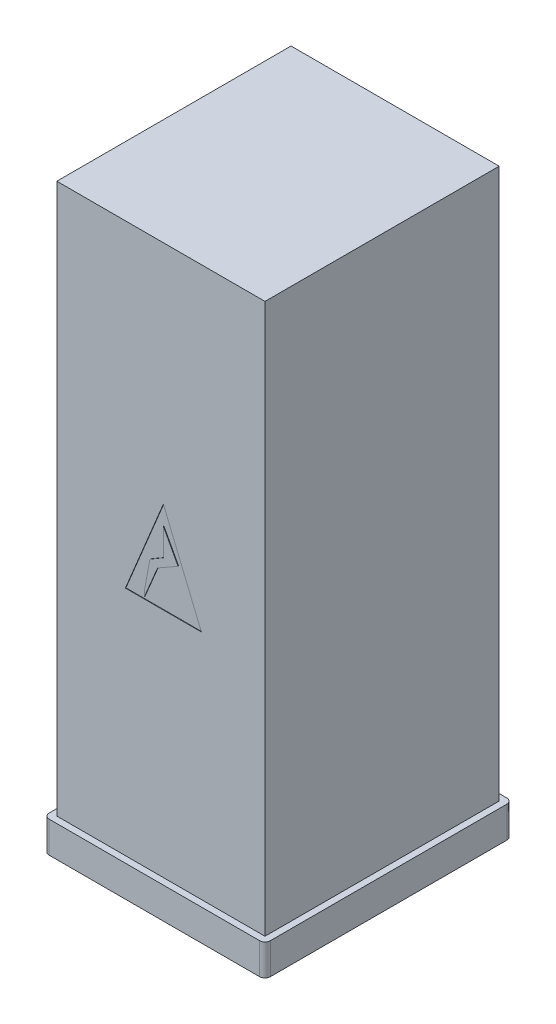
ISO-10303-21;
HEADER;
FILE_DESCRIPTION(('STEP AP214'),'2;1');
FILE_NAME('part.step','',(''),(''),'','','');
FILE_SCHEMA(('AUTOMOTIVE_DESIGN { 1 0 10303 214 1 1 1 1 }'));
ENDSEC;
DATA;
#1=APPLICATION_CONTEXT('core data for automotive mechanical design processes');
#2=APPLICATION_PROTOCOL_DEFINITION('international standard','automotive_design',2000,#1);
#3=PRODUCT_CONTEXT('',#1,'mechanical');
#4=PRODUCT('Part','Part','',(#3));
#5=PRODUCT_RELATED_PRODUCT_CATEGORY('part','',(#4));
#6=PRODUCT_DEFINITION_FORMATION('','',#4);
#7=PRODUCT_DEFINITION_CONTEXT('part definition',#1,'design');
#8=PRODUCT_DEFINITION('design','',#6,#7);
#9=PRODUCT_DEFINITION_SHAPE('','',#8);
#10=(LENGTH_UNIT() NAMED_UNIT(*) SI_UNIT(.MILLI.,.METRE.));
#11=(NAMED_UNIT(*) PLANE_ANGLE_UNIT() SI_UNIT($,.RADIAN.));
#12=(NAMED_UNIT(*) SI_UNIT($,.STERADIAN.) SOLID_ANGLE_UNIT());
#13=UNCERTAINTY_MEASURE_WITH_UNIT(LENGTH_MEASURE(1.E-05),#10,'distance_accuracy_value','');
#14=(GEOMETRIC_REPRESENTATION_CONTEXT(3) GLOBAL_UNCERTAINTY_ASSIGNED_CONTEXT((#13)) GLOBAL_UNIT_ASSIGNED_CONTEXT((#10,
#11,#12)) REPRESENTATION_CONTEXT('',''));
#15=CARTESIAN_POINT('',(0.,0.,0.));
#16=DIRECTION('',(0.,0.,1.));
#17=DIRECTION('',(1.,0.,0.));
#18=AXIS2_PLACEMENT_3D('',#15,#16,#17);
#19=CARTESIAN_POINT('',(-400.,2113.,450.));
#20=DIRECTION('',(0.,0.,-1.));
#21=DIRECTION('',(-1.,0.,0.));
#22=AXIS2_PLACEMENT_3D('',#19,#20,#21);
#23=PLANE('',#22);
#24=DIRECTION('',(1.,0.,0.));
#25=VECTOR('',#24,1.);
#26=CARTESIAN_POINT('',(-136.509991438893,890.520139483411,450.));
#27=LINE('',#26,#25);
#28=CARTESIAN_POINT('',(-136.509991438893,890.520139483411,450.));
#29=VERTEX_POINT('',#28);
#30=CARTESIAN_POINT('',(155.469712472072,890.520139483411,450.));
#31=VERTEX_POINT('',#30);
#32=EDGE_CURVE('E307',#29,#31,#27,.T.);
#33=ORIENTED_EDGE('',*,*,#32,.F.);
#34=DIRECTION('',(-0.382498039412264,-0.923956302995858,0.));
#35=VECTOR('',#34,1.);
#36=CARTESIAN_POINT('',(9.47986051658978,1243.17095070055,450.));
#37=LINE('',#36,#35);
#38=CARTESIAN_POINT('',(9.47986051658978,1243.17095070055,450.));
#39=VERTEX_POINT('',#38);
#40=EDGE_CURVE('E52',#39,#29,#37,.T.);
#41=ORIENTED_EDGE('',*,*,#40,.F.);
#42=DIRECTION('',(-0.382498039412264,0.923956302995858,0.));
#43=VECTOR('',#42,1.);
#44=CARTESIAN_POINT('',(155.469712472072,890.520139483411,450.));
#45=LINE('',#44,#43);
#46=EDGE_CURVE('E299',#31,#39,#45,.T.);
#47=ORIENTED_EDGE('',*,*,#46,.F.);
#48=EDGE_LOOP('',(#33,#41,#47));
#49=FACE_BOUND('',#48,.T.);
#50=DIRECTION('',(1.,0.,0.));
#51=VECTOR('',#50,1.);
#52=CARTESIAN_POINT('',(-400.,0.,450.));
#53=LINE('',#52,#51);
#54=CARTESIAN_POINT('',(-400.,0.,450.));
#55=VERTEX_POINT('',#54);
#56=CARTESIAN_POINT('',(400.,0.,450.));
#57=VERTEX_POINT('',#56);
#58=EDGE_CURVE('E350',#55,#57,#53,.T.);
#59=ORIENTED_EDGE('',*,*,#58,.T.);
#60=DIRECTION('',(0.,-1.,0.));
#61=VECTOR('',#60,1.);
#62=CARTESIAN_POINT('',(400.,2113.,450.));
#63=LINE('',#62,#61);
#64=CARTESIAN_POINT('',(400.,2113.,450.));
#65=VERTEX_POINT('',#64);
#66=EDGE_CURVE('E356',#65,#57,#63,.T.);
#67=ORIENTED_EDGE('',*,*,#66,.F.);
#68=DIRECTION('',(1.,0.,0.));
#69=VECTOR('',#68,1.);
#70=CARTESIAN_POINT('',(-400.,2113.,450.));
#71=LINE('',#70,#69);
#72=CARTESIAN_POINT('',(-400.,2113.,450.));
#73=VERTEX_POINT('',#72);
#74=EDGE_CURVE('E354',#73,#65,#71,.T.);
#75=ORIENTED_EDGE('',*,*,#74,.F.);
#76=DIRECTION('',(0.,-1.,0.));
#77=VECTOR('',#76,1.);
#78=CARTESIAN_POINT('',(-400.,2113.,450.));
#79=LINE('',#78,#77);
#80=EDGE_CURVE('E369',#73,#55,#79,.T.);
#81=ORIENTED_EDGE('',*,*,#80,.T.);
#82=EDGE_LOOP('',(#59,#67,#75,#81));
#83=FACE_BOUND('',#82,.T.);
#84=ADVANCED_FACE('F36',(#49,#83),#23,.F.);
#85=CARTESIAN_POINT('',(400.,2113.,-450.));
#86=DIRECTION('',(-1.,0.,0.));
#87=DIRECTION('',(0.,0.,1.));
#88=AXIS2_PLACEMENT_3D('',#85,#86,#87);
#89=PLANE('',#88);
#90=DIRECTION('',(0.,0.,-1.));
#91=VECTOR('',#90,1.);
#92=CARTESIAN_POINT('',(400.,0.,-450.));
#93=LINE('',#92,#91);
#94=CARTESIAN_POINT('',(400.,0.,-450.));
#95=VERTEX_POINT('',#94);
#96=EDGE_CURVE('E332',#57,#95,#93,.T.);
#97=ORIENTED_EDGE('',*,*,#96,.T.);
#98=DIRECTION('',(0.,-1.,0.));
#99=VECTOR('',#98,1.);
#100=CARTESIAN_POINT('',(400.,2113.,-450.));
#101=LINE('',#100,#99);
#102=CARTESIAN_POINT('',(400.,2113.,-450.));
#103=VERTEX_POINT('',#102);
#104=EDGE_CURVE('E11',#103,#95,#101,.T.);
#105=ORIENTED_EDGE('',*,*,#104,.F.);
#106=DIRECTION('',(0.,0.,-1.));
#107=VECTOR('',#106,1.);
#108=CARTESIAN_POINT('',(400.,2113.,-450.));
#109=LINE('',#108,#107);
#110=EDGE_CURVE('E346',#65,#103,#109,.T.);
#111=ORIENTED_EDGE('',*,*,#110,.F.);
#112=ORIENTED_EDGE('',*,*,#66,.T.);
#113=EDGE_LOOP('',(#97,#105,#111,#112));
#114=FACE_BOUND('',#113,.T.);
#115=ADVANCED_FACE('F38',(#114),#89,.F.);
#116=CARTESIAN_POINT('',(-400.,2113.,-450.));
#117=DIRECTION('',(0.,0.,1.));
#118=DIRECTION('',(1.,0.,0.));
#119=AXIS2_PLACEMENT_3D('',#116,#117,#118);
#120=PLANE('',#119);
#121=DIRECTION('',(-1.,0.,0.));
#122=VECTOR('',#121,1.);
#123=CARTESIAN_POINT('',(-400.,0.,-450.));
#124=LINE('',#123,#122);
#125=CARTESIAN_POINT('',(-400.,0.,-450.));
#126=VERTEX_POINT('',#125);
#127=EDGE_CURVE('E359',#95,#126,#124,.T.);
#128=ORIENTED_EDGE('',*,*,#127,.T.);
#129=DIRECTION('',(0.,-1.,0.));
#130=VECTOR('',#129,1.);
#131=CARTESIAN_POINT('',(-400.,2113.,-450.));
#132=LINE('',#131,#130);
#133=CARTESIAN_POINT('',(-400.,2113.,-450.));
#134=VERTEX_POINT('',#133);
#135=EDGE_CURVE('E45',#134,#126,#132,.T.);
#136=ORIENTED_EDGE('',*,*,#135,.F.);
#137=DIRECTION('',(-1.,0.,0.));
#138=VECTOR('',#137,1.);
#139=CARTESIAN_POINT('',(-400.,2113.,-450.));
#140=LINE('',#139,#138);
#141=EDGE_CURVE('E349',#103,#134,#140,.T.);
#142=ORIENTED_EDGE('',*,*,#141,.F.);
#143=ORIENTED_EDGE('',*,*,#104,.T.);
#144=EDGE_LOOP('',(#128,#136,#142,#143));
#145=FACE_BOUND('',#144,.T.);
#146=ADVANCED_FACE('F378',(#145),#120,.F.);
#147=CARTESIAN_POINT('',(-400.,2113.,-450.));
#148=DIRECTION('',(1.,0.,0.));
#149=DIRECTION('',(0.,0.,-1.));
#150=AXIS2_PLACEMENT_3D('',#147,#148,#149);
#151=PLANE('',#150);
#152=DIRECTION('',(0.,0.,1.));
#153=VECTOR('',#152,1.);
#154=CARTESIAN_POINT('',(-400.,0.,-450.));
#155=LINE('',#154,#153);
#156=EDGE_CURVE('E362',#126,#55,#155,.T.);
#157=ORIENTED_EDGE('',*,*,#156,.T.);
#158=ORIENTED_EDGE('',*,*,#80,.F.);
#159=DIRECTION('',(0.,0.,1.));
#160=VECTOR('',#159,1.);
#161=CARTESIAN_POINT('',(-400.,2113.,-450.));
#162=LINE('',#161,#160);
#163=EDGE_CURVE('E352',#134,#73,#162,.T.);
#164=ORIENTED_EDGE('',*,*,#163,.F.);
#165=ORIENTED_EDGE('',*,*,#135,.T.);
#166=EDGE_LOOP('',(#157,#158,#164,#165));
#167=FACE_BOUND('',#166,.T.);
#168=ADVANCED_FACE('F375',(#167),#151,.F.);
#169=CARTESIAN_POINT('',(0.,2113.,0.));
#170=DIRECTION('',(0.,1.,0.));
#171=DIRECTION('',(0.,0.,1.));
#172=AXIS2_PLACEMENT_3D('',#169,#170,#171);
#173=PLANE('',#172);
#174=ORIENTED_EDGE('',*,*,#110,.T.);
#175=ORIENTED_EDGE('',*,*,#141,.T.);
#176=ORIENTED_EDGE('',*,*,#163,.T.);
#177=ORIENTED_EDGE('',*,*,#74,.T.);
#178=EDGE_LOOP('',(#174,#175,#176,#177));
#179=FACE_BOUND('',#178,.T.);
#180=ADVANCED_FACE('F388',(#179),#173,.T.);
#181=CARTESIAN_POINT('',(9.47986051658978,1243.17095070055,448.));
#182=DIRECTION('',(-0.923956302995858,0.382498039412264,0.));
#183=DIRECTION('',(-0.382498039412264,-0.923956302995858,0.));
#184=AXIS2_PLACEMENT_3D('',#181,#182,#183);
#185=PLANE('',#184);
#186=ORIENTED_EDGE('',*,*,#40,.T.);
#187=DIRECTION('',(0.,0.,1.));
#188=VECTOR('',#187,1.);
#189=CARTESIAN_POINT('',(-136.509991438893,890.520139483411,448.));
#190=LINE('',#189,#188);
#191=CARTESIAN_POINT('',(-136.509991438893,890.520139483411,448.));
#192=VERTEX_POINT('',#191);
#193=EDGE_CURVE('E305',#192,#29,#190,.T.);
#194=ORIENTED_EDGE('',*,*,#193,.F.);
#195=DIRECTION('',(-0.382498039412264,-0.923956302995858,0.));
#196=VECTOR('',#195,1.);
#197=CARTESIAN_POINT('',(9.47986051658978,1243.17095070055,448.));
#198=LINE('',#197,#196);
#199=CARTESIAN_POINT('',(9.47986051658978,1243.17095070055,448.));
#200=VERTEX_POINT('',#199);
#201=EDGE_CURVE('E295',#200,#192,#198,.T.);
#202=ORIENTED_EDGE('',*,*,#201,.F.);
#203=DIRECTION('',(0.,0.,1.));
#204=VECTOR('',#203,1.);
#205=CARTESIAN_POINT('',(9.47986051658978,1243.17095070055,448.));
#206=LINE('',#205,#204);
#207=EDGE_CURVE('E312',#200,#39,#206,.T.);
#208=ORIENTED_EDGE('',*,*,#207,.T.);
#209=EDGE_LOOP('',(#186,#194,#202,#208));
#210=FACE_BOUND('',#209,.T.);
#211=ADVANCED_FACE('F390',(#210),#185,.F.);
#212=CARTESIAN_POINT('',(155.469712472072,890.520139483411,448.));
#213=DIRECTION('',(0.923956302995858,0.382498039412264,0.));
#214=DIRECTION('',(-0.382498039412264,0.923956302995858,0.));
#215=AXIS2_PLACEMENT_3D('',#212,#213,#214);
#216=PLANE('',#215);
#217=ORIENTED_EDGE('',*,*,#46,.T.);
#218=ORIENTED_EDGE('',*,*,#207,.F.);
#219=DIRECTION('',(-0.382498039412264,0.923956302995858,0.));
#220=VECTOR('',#219,1.);
#221=CARTESIAN_POINT('',(155.469712472072,890.520139483411,448.));
#222=LINE('',#221,#220);
#223=CARTESIAN_POINT('',(155.469712472072,890.520139483411,448.));
#224=VERTEX_POINT('',#223);
#225=EDGE_CURVE('E302',#224,#200,#222,.T.);
#226=ORIENTED_EDGE('',*,*,#225,.F.);
#227=DIRECTION('',(0.,0.,1.));
#228=VECTOR('',#227,1.);
#229=CARTESIAN_POINT('',(155.469712472072,890.520139483411,448.));
#230=LINE('',#229,#228);
#231=EDGE_CURVE('E315',#224,#31,#230,.T.);
#232=ORIENTED_EDGE('',*,*,#231,.T.);
#233=EDGE_LOOP('',(#217,#218,#226,#232));
#234=FACE_BOUND('',#233,.T.);
#235=ADVANCED_FACE('F396',(#234),#216,.F.);
#236=CARTESIAN_POINT('',(-136.509991438893,890.520139483411,448.));
#237=DIRECTION('',(0.,-1.,0.));
#238=DIRECTION('',(0.,0.,-1.));
#239=AXIS2_PLACEMENT_3D('',#236,#237,#238);
#240=PLANE('',#239);
#241=ORIENTED_EDGE('',*,*,#32,.T.);
#242=ORIENTED_EDGE('',*,*,#231,.F.);
#243=DIRECTION('',(1.,0.,0.));
#244=VECTOR('',#243,1.);
#245=CARTESIAN_POINT('',(-136.509991438893,890.520139483411,448.));
#246=LINE('',#245,#244);
#247=EDGE_CURVE('E298',#192,#224,#246,.T.);
#248=ORIENTED_EDGE('',*,*,#247,.F.);
#249=ORIENTED_EDGE('',*,*,#193,.T.);
#250=EDGE_LOOP('',(#241,#242,#248,#249));
#251=FACE_BOUND('',#250,.T.);
#252=ADVANCED_FACE('F464',(#251),#240,.F.);
#253=CARTESIAN_POINT('',(0.,0.,448.));
#254=DIRECTION('',(0.,0.,1.));
#255=DIRECTION('',(1.,0.,0.));
#256=AXIS2_PLACEMENT_3D('',#253,#254,#255);
#257=PLANE('',#256);
#258=DIRECTION('',(-0.181458170868249,-0.983398663932969,0.));
#259=VECTOR('',#258,1.);
#260=CARTESIAN_POINT('',(-63.1768087324265,920.194596150194,448.));
#261=LINE('',#260,#259);
#262=CARTESIAN_POINT('',(-42.1695458219167,1034.04184910241,448.));
#263=VERTEX_POINT('',#262);
#264=CARTESIAN_POINT('',(-63.1768087324265,920.194596150194,448.));
#265=VERTEX_POINT('',#264);
#266=EDGE_CURVE('E264',#263,#265,#261,.T.);
#267=ORIENTED_EDGE('',*,*,#266,.F.);
#268=DIRECTION('',(-0.863784349846672,-0.503861684353913,0.));
#269=VECTOR('',#268,1.);
#270=CARTESIAN_POINT('',(-42.1695458219167,1034.04184910241,448.));
#271=LINE('',#270,#269);
#272=CARTESIAN_POINT('',(9.47986051658978,1064.16992085807,448.));
#273=VERTEX_POINT('',#272);
#274=EDGE_CURVE('E261',#273,#263,#271,.T.);
#275=ORIENTED_EDGE('',*,*,#274,.F.);
#276=DIRECTION('',(0.,-1.,0.));
#277=VECTOR('',#276,1.);
#278=CARTESIAN_POINT('',(9.47986051658978,1064.16992085807,448.));
#279=LINE('',#278,#277);
#280=CARTESIAN_POINT('',(9.47986051658978,1169.41196385255,448.));
#281=VERTEX_POINT('',#280);
#282=EDGE_CURVE('E258',#281,#273,#279,.T.);
#283=ORIENTED_EDGE('',*,*,#282,.F.);
#284=DIRECTION('',(-0.472916146029514,0.881107438865767,0.));
#285=VECTOR('',#284,1.);
#286=CARTESIAN_POINT('',(9.47986051658978,1169.41196385255,448.));
#287=LINE('',#286,#285);
#288=CARTESIAN_POINT('',(65.9663446589673,1064.16992085807,448.));
#289=VERTEX_POINT('',#288);
#290=EDGE_CURVE('E255',#289,#281,#287,.T.);
#291=ORIENTED_EDGE('',*,*,#290,.F.);
#292=DIRECTION('',(0.869719659928419,0.493546059789758,0.));
#293=VECTOR('',#292,1.);
#294=CARTESIAN_POINT('',(65.9663446589673,1064.16992085807,448.));
#295=LINE('',#294,#293);
#296=CARTESIAN_POINT('',(-12.5323017641928,1019.62373037163,448.));
#297=VERTEX_POINT('',#296);
#298=EDGE_CURVE('E252',#297,#289,#295,.T.);
#299=ORIENTED_EDGE('',*,*,#298,.F.);
#300=DIRECTION('',(0.386882203116871,0.922129145462519,0.));
#301=VECTOR('',#300,1.);
#302=CARTESIAN_POINT('',(-12.5323017641928,1019.62373037163,448.));
#303=LINE('',#302,#301);
#304=CARTESIAN_POINT('',(-63.1768087324265,898.91314829587,448.));
#305=VERTEX_POINT('',#304);
#306=EDGE_CURVE('E248',#305,#297,#303,.T.);
#307=ORIENTED_EDGE('',*,*,#306,.F.);
#308=DIRECTION('',(0.,-1.,0.));
#309=VECTOR('',#308,1.);
#310=CARTESIAN_POINT('',(-63.1768087324265,898.91314829587,448.));
#311=LINE('',#310,#309);
#312=EDGE_CURVE('E245',#265,#305,#311,.T.);
#313=ORIENTED_EDGE('',*,*,#312,.F.);
#314=EDGE_LOOP('',(#267,#275,#283,#291,#299,#307,#313));
#315=FACE_BOUND('',#314,.T.);
#316=ORIENTED_EDGE('',*,*,#201,.T.);
#317=ORIENTED_EDGE('',*,*,#247,.T.);
#318=ORIENTED_EDGE('',*,*,#225,.T.);
#319=EDGE_LOOP('',(#316,#317,#318));
#320=FACE_BOUND('',#319,.T.);
#321=ADVANCED_FACE('F431',(#315,#320),#257,.T.);
#322=CARTESIAN_POINT('',(-63.1768087324265,898.91314829587,448.));
#323=DIRECTION('',(-1.,0.,0.));
#324=DIRECTION('',(0.,0.,1.));
#325=AXIS2_PLACEMENT_3D('',#322,#323,#324);
#326=PLANE('',#325);
#327=DIRECTION('',(0.,-1.,0.));
#328=VECTOR('',#327,1.);
#329=CARTESIAN_POINT('',(-63.1768087324265,898.91314829587,450.));
#330=LINE('',#329,#328);
#331=CARTESIAN_POINT('',(-63.1768087324265,920.194596150194,450.));
#332=VERTEX_POINT('',#331);
#333=CARTESIAN_POINT('',(-63.1768087324264,898.91314829587,450.));
#334=VERTEX_POINT('',#333);
#335=EDGE_CURVE('E236',#332,#334,#330,.T.);
#336=ORIENTED_EDGE('',*,*,#335,.F.);
#337=DIRECTION('',(0.,0.,1.));
#338=VECTOR('',#337,1.);
#339=CARTESIAN_POINT('',(-63.1768087324265,920.194596150194,448.));
#340=LINE('',#339,#338);
#341=EDGE_CURVE('E282',#265,#332,#340,.T.);
#342=ORIENTED_EDGE('',*,*,#341,.F.);
#343=ORIENTED_EDGE('',*,*,#312,.T.);
#344=DIRECTION('',(0.,0.,1.));
#345=VECTOR('',#344,1.);
#346=CARTESIAN_POINT('',(-63.1768087324265,898.91314829587,448.));
#347=LINE('',#346,#345);
#348=EDGE_CURVE('E266',#305,#334,#347,.T.);
#349=ORIENTED_EDGE('',*,*,#348,.T.);
#350=EDGE_LOOP('',(#336,#342,#343,#349));
#351=FACE_BOUND('',#350,.T.);
#352=ADVANCED_FACE('F424',(#351),#326,.T.);
#353=CARTESIAN_POINT('',(-63.1768087324265,920.194596150194,448.));
#354=DIRECTION('',(-0.983398663932969,0.181458170868249,0.));
#355=DIRECTION('',(-0.181458170868249,-0.983398663932969,0.));
#356=AXIS2_PLACEMENT_3D('',#353,#354,#355);
#357=PLANE('',#356);
#358=DIRECTION('',(-0.181458170868249,-0.983398663932969,0.));
#359=VECTOR('',#358,1.);
#360=CARTESIAN_POINT('',(-63.1768087324265,920.194596150194,450.));
#361=LINE('',#360,#359);
#362=CARTESIAN_POINT('',(-42.1695458219167,1034.04184910241,450.));
#363=VERTEX_POINT('',#362);
#364=EDGE_CURVE('E249',#363,#332,#361,.T.);
#365=ORIENTED_EDGE('',*,*,#364,.F.);
#366=DIRECTION('',(0.,0.,1.));
#367=VECTOR('',#366,1.);
#368=CARTESIAN_POINT('',(-42.1695458219167,1034.04184910241,448.));
#369=LINE('',#368,#367);
#370=EDGE_CURVE('E284',#263,#363,#369,.T.);
#371=ORIENTED_EDGE('',*,*,#370,.F.);
#372=ORIENTED_EDGE('',*,*,#266,.T.);
#373=ORIENTED_EDGE('',*,*,#341,.T.);
#374=EDGE_LOOP('',(#365,#371,#372,#373));
#375=FACE_BOUND('',#374,.T.);
#376=ADVANCED_FACE('F444',(#375),#357,.T.);
#377=CARTESIAN_POINT('',(-42.1695458219167,1034.04184910241,448.));
#378=DIRECTION('',(-0.503861684353913,0.863784349846672,0.));
#379=DIRECTION('',(-0.863784349846672,-0.503861684353913,0.));
#380=AXIS2_PLACEMENT_3D('',#377,#378,#379);
#381=PLANE('',#380);
#382=DIRECTION('',(-0.863784349846672,-0.503861684353913,0.));
#383=VECTOR('',#382,1.);
#384=CARTESIAN_POINT('',(-42.1695458219167,1034.04184910241,450.));
#385=LINE('',#384,#383);
#386=CARTESIAN_POINT('',(9.47986051658978,1064.16992085807,450.));
#387=VERTEX_POINT('',#386);
#388=EDGE_CURVE('E277',#387,#363,#385,.T.);
#389=ORIENTED_EDGE('',*,*,#388,.F.);
#390=DIRECTION('',(0.,0.,1.));
#391=VECTOR('',#390,1.);
#392=CARTESIAN_POINT('',(9.47986051658978,1064.16992085807,448.));
#393=LINE('',#392,#391);
#394=EDGE_CURVE('E286',#273,#387,#393,.T.);
#395=ORIENTED_EDGE('',*,*,#394,.F.);
#396=ORIENTED_EDGE('',*,*,#274,.T.);
#397=ORIENTED_EDGE('',*,*,#370,.T.);
#398=EDGE_LOOP('',(#389,#395,#396,#397));
#399=FACE_BOUND('',#398,.T.);
#400=ADVANCED_FACE('F442',(#399),#381,.T.);
#401=CARTESIAN_POINT('',(9.47986051658978,1064.16992085807,448.));
#402=DIRECTION('',(-1.,0.,0.));
#403=DIRECTION('',(0.,0.,1.));
#404=AXIS2_PLACEMENT_3D('',#401,#402,#403);
#405=PLANE('',#404);
#406=DIRECTION('',(0.,-1.,0.));
#407=VECTOR('',#406,1.);
#408=CARTESIAN_POINT('',(9.47986051658978,1064.16992085807,450.));
#409=LINE('',#408,#407);
#410=CARTESIAN_POINT('',(9.47986051658978,1169.41196385255,450.));
#411=VERTEX_POINT('',#410);
#412=EDGE_CURVE('E274',#411,#387,#409,.T.);
#413=ORIENTED_EDGE('',*,*,#412,.F.);
#414=DIRECTION('',(0.,0.,1.));
#415=VECTOR('',#414,1.);
#416=CARTESIAN_POINT('',(9.47986051658978,1169.41196385255,448.));
#417=LINE('',#416,#415);
#418=EDGE_CURVE('E288',#281,#411,#417,.T.);
#419=ORIENTED_EDGE('',*,*,#418,.F.);
#420=ORIENTED_EDGE('',*,*,#282,.T.);
#421=ORIENTED_EDGE('',*,*,#394,.T.);
#422=EDGE_LOOP('',(#413,#419,#420,#421));
#423=FACE_BOUND('',#422,.T.);
#424=ADVANCED_FACE('F440',(#423),#405,.T.);
#425=CARTESIAN_POINT('',(9.47986051658978,1169.41196385255,448.));
#426=DIRECTION('',(0.881107438865767,0.472916146029514,0.));
#427=DIRECTION('',(-0.472916146029514,0.881107438865767,0.));
#428=AXIS2_PLACEMENT_3D('',#425,#426,#427);
#429=PLANE('',#428);
#430=DIRECTION('',(-0.472916146029514,0.881107438865767,0.));
#431=VECTOR('',#430,1.);
#432=CARTESIAN_POINT('',(9.47986051658978,1169.41196385255,450.));
#433=LINE('',#432,#431);
#434=CARTESIAN_POINT('',(65.9663446589673,1064.16992085807,450.));
#435=VERTEX_POINT('',#434);
#436=EDGE_CURVE('E271',#435,#411,#433,.T.);
#437=ORIENTED_EDGE('',*,*,#436,.F.);
#438=DIRECTION('',(0.,0.,1.));
#439=VECTOR('',#438,1.);
#440=CARTESIAN_POINT('',(65.9663446589673,1064.16992085807,448.));
#441=LINE('',#440,#439);
#442=EDGE_CURVE('E290',#289,#435,#441,.T.);
#443=ORIENTED_EDGE('',*,*,#442,.F.);
#444=ORIENTED_EDGE('',*,*,#290,.T.);
#445=ORIENTED_EDGE('',*,*,#418,.T.);
#446=EDGE_LOOP('',(#437,#443,#444,#445));
#447=FACE_BOUND('',#446,.T.);
#448=ADVANCED_FACE('F436',(#447),#429,.T.);
#449=CARTESIAN_POINT('',(65.9663446589673,1064.16992085807,448.));
#450=DIRECTION('',(0.493546059789758,-0.869719659928419,0.));
#451=DIRECTION('',(0.869719659928419,0.493546059789758,0.));
#452=AXIS2_PLACEMENT_3D('',#449,#450,#451);
#453=PLANE('',#452);
#454=DIRECTION('',(0.869719659928419,0.493546059789758,0.));
#455=VECTOR('',#454,1.);
#456=CARTESIAN_POINT('',(65.9663446589673,1064.16992085807,450.));
#457=LINE('',#456,#455);
#458=CARTESIAN_POINT('',(-12.532301764193,1019.62373037163,450.));
#459=VERTEX_POINT('',#458);
#460=EDGE_CURVE('E60',#459,#435,#457,.T.);
#461=ORIENTED_EDGE('',*,*,#460,.F.);
#462=DIRECTION('',(0.,0.,1.));
#463=VECTOR('',#462,1.);
#464=CARTESIAN_POINT('',(-12.5323017641928,1019.62373037163,448.));
#465=LINE('',#464,#463);
#466=EDGE_CURVE('E292',#297,#459,#465,.T.);
#467=ORIENTED_EDGE('',*,*,#466,.F.);
#468=ORIENTED_EDGE('',*,*,#298,.T.);
#469=ORIENTED_EDGE('',*,*,#442,.T.);
#470=EDGE_LOOP('',(#461,#467,#468,#469));
#471=FACE_BOUND('',#470,.T.);
#472=ADVANCED_FACE('F417',(#471),#453,.T.);
#473=CARTESIAN_POINT('',(-12.5323017641928,1019.62373037163,448.));
#474=DIRECTION('',(0.922129145462519,-0.386882203116871,0.));
#475=DIRECTION('',(0.386882203116871,0.92212914546252,0.));
#476=AXIS2_PLACEMENT_3D('',#473,#474,#475);
#477=PLANE('',#476);
#478=DIRECTION('',(0.386882203116871,0.922129145462519,0.));
#479=VECTOR('',#478,1.);
#480=CARTESIAN_POINT('',(-12.5323017641928,1019.62373037163,450.));
#481=LINE('',#480,#479);
#482=EDGE_CURVE('E239',#334,#459,#481,.T.);
#483=ORIENTED_EDGE('',*,*,#482,.F.);
#484=ORIENTED_EDGE('',*,*,#348,.F.);
#485=ORIENTED_EDGE('',*,*,#306,.T.);
#486=ORIENTED_EDGE('',*,*,#466,.T.);
#487=EDGE_LOOP('',(#483,#484,#485,#486));
#488=FACE_BOUND('',#487,.T.);
#489=ADVANCED_FACE('F409',(#488),#477,.T.);
#490=ORIENTED_EDGE('',*,*,#335,.T.);
#491=ORIENTED_EDGE('',*,*,#482,.T.);
#492=ORIENTED_EDGE('',*,*,#460,.T.);
#493=ORIENTED_EDGE('',*,*,#436,.T.);
#494=ORIENTED_EDGE('',*,*,#412,.T.);
#495=ORIENTED_EDGE('',*,*,#388,.T.);
#496=ORIENTED_EDGE('',*,*,#364,.T.);
#497=EDGE_LOOP('',(#490,#491,#492,#493,#494,#495,#496));
#498=FACE_BOUND('',#497,.T.);
#499=ADVANCED_FACE('F403',(#498),#23,.F.);
#500=CARTESIAN_POINT('',(404.356451520061,0.,454.356451520061));
#501=DIRECTION('',(0.,1.,0.));
#502=DIRECTION('',(0.,0.,1.));
#503=AXIS2_PLACEMENT_3D('',#500,#501,#502);
#504=PLANE('',#503);
#505=CARTESIAN_POINT('',(404.356451520061,0.,454.356451520061));
#506=DIRECTION('',(0.,-1.,0.));
#507=DIRECTION('',(0.,0.,1.));
#508=AXIS2_PLACEMENT_3D('',#505,#506,#507);
#509=CIRCLE('',#508,20.6435484799389);
#510=CARTESIAN_POINT('',(425.,0.,454.356451520061));
#511=VERTEX_POINT('',#510);
#512=CARTESIAN_POINT('',(404.356451520061,0.,475.));
#513=VERTEX_POINT('',#512);
#514=EDGE_CURVE('E235',#511,#513,#509,.T.);
#515=ORIENTED_EDGE('',*,*,#514,.F.);
#516=DIRECTION('',(0.,0.,1.));
#517=VECTOR('',#516,1.);
#518=CARTESIAN_POINT('',(425.,0.,454.356451520061));
#519=LINE('',#518,#517);
#520=CARTESIAN_POINT('',(425.,0.,-454.356451520061));
#521=VERTEX_POINT('',#520);
#522=EDGE_CURVE('E231',#521,#511,#519,.T.);
#523=ORIENTED_EDGE('',*,*,#522,.F.);
#524=CARTESIAN_POINT('',(404.356451520061,0.,-454.356451520061));
#525=DIRECTION('',(0.,-1.,0.));
#526=DIRECTION('',(0.,0.,-1.));
#527=AXIS2_PLACEMENT_3D('',#524,#525,#526);
#528=CIRCLE('',#527,20.6435484799389);
#529=CARTESIAN_POINT('',(404.356451520061,0.,-475.));
#530=VERTEX_POINT('',#529);
#531=EDGE_CURVE('E762',#530,#521,#528,.T.);
#532=ORIENTED_EDGE('',*,*,#531,.F.);
#533=DIRECTION('',(1.,0.,0.));
#534=VECTOR('',#533,1.);
#535=CARTESIAN_POINT('',(-404.356451520061,0.,-475.));
#536=LINE('',#535,#534);
#537=CARTESIAN_POINT('',(-404.356451520061,0.,-475.));
#538=VERTEX_POINT('',#537);
#539=EDGE_CURVE('E778',#538,#530,#536,.T.);
#540=ORIENTED_EDGE('',*,*,#539,.F.);
#541=CARTESIAN_POINT('',(-404.356451520061,0.,-454.356451520061));
#542=DIRECTION('',(0.,-1.,0.));
#543=DIRECTION('',(0.,0.,-1.));
#544=AXIS2_PLACEMENT_3D('',#541,#542,#543);
#545=CIRCLE('',#544,20.6435484799389);
#546=CARTESIAN_POINT('',(-425.,0.,-454.356451520061));
#547=VERTEX_POINT('',#546);
#548=EDGE_CURVE('E776',#547,#538,#545,.T.);
#549=ORIENTED_EDGE('',*,*,#548,.F.);
#550=DIRECTION('',(0.,0.,-1.));
#551=VECTOR('',#550,1.);
#552=CARTESIAN_POINT('',(-425.,0.,454.356451520061));
#553=LINE('',#552,#551);
#554=CARTESIAN_POINT('',(-425.,0.,454.356451520061));
#555=VERTEX_POINT('',#554);
#556=EDGE_CURVE('E774',#555,#547,#553,.T.);
#557=ORIENTED_EDGE('',*,*,#556,.F.);
#558=CARTESIAN_POINT('',(-404.356451520061,0.,454.356451520061));
#559=DIRECTION('',(0.,-1.,0.));
#560=DIRECTION('',(0.,0.,-1.));
#561=AXIS2_PLACEMENT_3D('',#558,#559,#560);
#562=CIRCLE('',#561,20.6435484799389);
#563=CARTESIAN_POINT('',(-404.356451520061,0.,475.));
#564=VERTEX_POINT('',#563);
#565=EDGE_CURVE('E768',#564,#555,#562,.T.);
#566=ORIENTED_EDGE('',*,*,#565,.F.);
#567=DIRECTION('',(-1.,0.,0.));
#568=VECTOR('',#567,1.);
#569=CARTESIAN_POINT('',(-404.356451520061,0.,475.));
#570=LINE('',#569,#568);
#571=EDGE_CURVE('E766',#513,#564,#570,.T.);
#572=ORIENTED_EDGE('',*,*,#571,.F.);
#573=EDGE_LOOP('',(#515,#523,#532,#540,#549,#557,#566,#572));
#574=FACE_BOUND('',#573,.T.);
#575=ORIENTED_EDGE('',*,*,#58,.F.);
#576=ORIENTED_EDGE('',*,*,#156,.F.);
#577=ORIENTED_EDGE('',*,*,#127,.F.);
#578=ORIENTED_EDGE('',*,*,#96,.F.);
#579=EDGE_LOOP('',(#575,#576,#577,#578));
#580=FACE_BOUND('',#579,.T.);
#581=ADVANCED_FACE('F381',(#574,#580),#504,.T.);
#582=CARTESIAN_POINT('',(404.356451520061,-120.,454.356451520061));
#583=DIRECTION('',(0.,1.,0.));
#584=DIRECTION('',(0.,0.,1.));
#585=AXIS2_PLACEMENT_3D('',#582,#583,#584);
#586=CYLINDRICAL_SURFACE('',#585,20.6435484799389);
#587=ORIENTED_EDGE('',*,*,#514,.T.);
#588=DIRECTION('',(0.,1.,0.));
#589=VECTOR('',#588,1.);
#590=CARTESIAN_POINT('',(404.356451520061,-120.,475.));
#591=LINE('',#590,#589);
#592=CARTESIAN_POINT('',(404.356451520061,-120.,475.));
#593=VERTEX_POINT('',#592);
#594=EDGE_CURVE('E215',#593,#513,#591,.T.);
#595=ORIENTED_EDGE('',*,*,#594,.F.);
#596=CARTESIAN_POINT('',(404.356451520061,-120.,454.356451520061));
#597=DIRECTION('',(0.,-1.,0.));
#598=DIRECTION('',(0.,0.,1.));
#599=AXIS2_PLACEMENT_3D('',#596,#597,#598);
#600=CIRCLE('',#599,20.6435484799389);
#601=CARTESIAN_POINT('',(425.,-120.,454.356451520061));
#602=VERTEX_POINT('',#601);
#603=EDGE_CURVE('E222',#602,#593,#600,.T.);
#604=ORIENTED_EDGE('',*,*,#603,.F.);
#605=DIRECTION('',(0.,1.,0.));
#606=VECTOR('',#605,1.);
#607=CARTESIAN_POINT('',(425.,-120.,454.356451520061));
#608=LINE('',#607,#606);
#609=EDGE_CURVE('E758',#602,#511,#608,.T.);
#610=ORIENTED_EDGE('',*,*,#609,.T.);
#611=EDGE_LOOP('',(#587,#595,#604,#610));
#612=FACE_BOUND('',#611,.T.);
#613=ADVANCED_FACE('F233',(#612),#586,.T.);
#614=CARTESIAN_POINT('',(-404.356451520061,-120.,475.));
#615=DIRECTION('',(0.,0.,-1.));
#616=DIRECTION('',(-1.,0.,0.));
#617=AXIS2_PLACEMENT_3D('',#614,#615,#616);
#618=PLANE('',#617);
#619=ORIENTED_EDGE('',*,*,#571,.T.);
#620=DIRECTION('',(0.,1.,0.));
#621=VECTOR('',#620,1.);
#622=CARTESIAN_POINT('',(-404.356451520061,-120.,475.));
#623=LINE('',#622,#621);
#624=CARTESIAN_POINT('',(-404.356451520061,-120.,475.));
#625=VERTEX_POINT('',#624);
#626=EDGE_CURVE('E218',#625,#564,#623,.T.);
#627=ORIENTED_EDGE('',*,*,#626,.F.);
#628=DIRECTION('',(-1.,0.,0.));
#629=VECTOR('',#628,1.);
#630=CARTESIAN_POINT('',(-404.356451520061,-120.,475.));
#631=LINE('',#630,#629);
#632=EDGE_CURVE('E211',#593,#625,#631,.T.);
#633=ORIENTED_EDGE('',*,*,#632,.F.);
#634=ORIENTED_EDGE('',*,*,#594,.T.);
#635=EDGE_LOOP('',(#619,#627,#633,#634));
#636=FACE_BOUND('',#635,.T.);
#637=ADVANCED_FACE('F213',(#636),#618,.F.);
#638=CARTESIAN_POINT('',(-404.356451520061,-120.,454.356451520061));
#639=DIRECTION('',(0.,1.,0.));
#640=DIRECTION('',(0.,0.,1.));
#641=AXIS2_PLACEMENT_3D('',#638,#639,#640);
#642=CYLINDRICAL_SURFACE('',#641,20.6435484799389);
#643=ORIENTED_EDGE('',*,*,#565,.T.);
#644=DIRECTION('',(0.,1.,0.));
#645=VECTOR('',#644,1.);
#646=CARTESIAN_POINT('',(-425.,-120.,454.356451520061));
#647=LINE('',#646,#645);
#648=CARTESIAN_POINT('',(-425.,-120.,454.356451520061));
#649=VERTEX_POINT('',#648);
#650=EDGE_CURVE('E241',#649,#555,#647,.T.);
#651=ORIENTED_EDGE('',*,*,#650,.F.);
#652=CARTESIAN_POINT('',(-404.356451520061,-120.,454.356451520061));
#653=DIRECTION('',(0.,-1.,0.));
#654=DIRECTION('',(0.,0.,-1.));
#655=AXIS2_PLACEMENT_3D('',#652,#653,#654);
#656=CIRCLE('',#655,20.6435484799389);
#657=EDGE_CURVE('E221',#625,#649,#656,.T.);
#658=ORIENTED_EDGE('',*,*,#657,.F.);
#659=ORIENTED_EDGE('',*,*,#626,.T.);
#660=EDGE_LOOP('',(#643,#651,#658,#659));
#661=FACE_BOUND('',#660,.T.);
#662=ADVANCED_FACE('F646',(#661),#642,.T.);
#663=CARTESIAN_POINT('',(-425.,-120.,454.356451520061));
#664=DIRECTION('',(1.,0.,0.));
#665=DIRECTION('',(0.,0.,-1.));
#666=AXIS2_PLACEMENT_3D('',#663,#664,#665);
#667=PLANE('',#666);
#668=ORIENTED_EDGE('',*,*,#556,.T.);
#669=DIRECTION('',(0.,1.,0.));
#670=VECTOR('',#669,1.);
#671=CARTESIAN_POINT('',(-425.,-120.,-454.356451520061));
#672=LINE('',#671,#670);
#673=CARTESIAN_POINT('',(-425.,-120.,-454.356451520061));
#674=VERTEX_POINT('',#673);
#675=EDGE_CURVE('E788',#674,#547,#672,.T.);
#676=ORIENTED_EDGE('',*,*,#675,.F.);
#677=DIRECTION('',(0.,0.,-1.));
#678=VECTOR('',#677,1.);
#679=CARTESIAN_POINT('',(-425.,-120.,454.356451520061));
#680=LINE('',#679,#678);
#681=EDGE_CURVE('E795',#649,#674,#680,.T.);
#682=ORIENTED_EDGE('',*,*,#681,.F.);
#683=ORIENTED_EDGE('',*,*,#650,.T.);
#684=EDGE_LOOP('',(#668,#676,#682,#683));
#685=FACE_BOUND('',#684,.T.);
#686=ADVANCED_FACE('F655',(#685),#667,.F.);
#687=CARTESIAN_POINT('',(-404.356451520061,-120.,-454.356451520061));
#688=DIRECTION('',(0.,1.,0.));
#689=DIRECTION('',(0.,0.,1.));
#690=AXIS2_PLACEMENT_3D('',#687,#688,#689);
#691=CYLINDRICAL_SURFACE('',#690,20.6435484799389);
#692=ORIENTED_EDGE('',*,*,#548,.T.);
#693=DIRECTION('',(0.,1.,0.));
#694=VECTOR('',#693,1.);
#695=CARTESIAN_POINT('',(-404.356451520061,-120.,-475.));
#696=LINE('',#695,#694);
#697=CARTESIAN_POINT('',(-404.356451520061,-120.,-475.));
#698=VERTEX_POINT('',#697);
#699=EDGE_CURVE('E785',#698,#538,#696,.T.);
#700=ORIENTED_EDGE('',*,*,#699,.F.);
#701=CARTESIAN_POINT('',(-404.356451520061,-120.,-454.356451520061));
#702=DIRECTION('',(0.,-1.,0.));
#703=DIRECTION('',(0.,0.,-1.));
#704=AXIS2_PLACEMENT_3D('',#701,#702,#703);
#705=CIRCLE('',#704,20.6435484799389);
#706=EDGE_CURVE('E805',#674,#698,#705,.T.);
#707=ORIENTED_EDGE('',*,*,#706,.F.);
#708=ORIENTED_EDGE('',*,*,#675,.T.);
#709=EDGE_LOOP('',(#692,#700,#707,#708));
#710=FACE_BOUND('',#709,.T.);
#711=ADVANCED_FACE('F665',(#710),#691,.T.);
#712=CARTESIAN_POINT('',(-404.356451520061,-120.,-475.));
#713=DIRECTION('',(0.,0.,1.));
#714=DIRECTION('',(1.,0.,0.));
#715=AXIS2_PLACEMENT_3D('',#712,#713,#714);
#716=PLANE('',#715);
#717=ORIENTED_EDGE('',*,*,#539,.T.);
#718=DIRECTION('',(0.,1.,0.));
#719=VECTOR('',#718,1.);
#720=CARTESIAN_POINT('',(404.356451520061,-120.,-475.));
#721=LINE('',#720,#719);
#722=CARTESIAN_POINT('',(404.356451520061,-120.,-475.));
#723=VERTEX_POINT('',#722);
#724=EDGE_CURVE('E782',#723,#530,#721,.T.);
#725=ORIENTED_EDGE('',*,*,#724,.F.);
#726=DIRECTION('',(1.,0.,0.));
#727=VECTOR('',#726,1.);
#728=CARTESIAN_POINT('',(-404.356451520061,-120.,-475.));
#729=LINE('',#728,#727);
#730=EDGE_CURVE('E802',#698,#723,#729,.T.);
#731=ORIENTED_EDGE('',*,*,#730,.F.);
#732=ORIENTED_EDGE('',*,*,#699,.T.);
#733=EDGE_LOOP('',(#717,#725,#731,#732));
#734=FACE_BOUND('',#733,.T.);
#735=ADVANCED_FACE('F676',(#734),#716,.F.);
#736=CARTESIAN_POINT('',(404.356451520061,-120.,-454.356451520061));
#737=DIRECTION('',(0.,1.,0.));
#738=DIRECTION('',(0.,0.,1.));
#739=AXIS2_PLACEMENT_3D('',#736,#737,#738);
#740=CYLINDRICAL_SURFACE('',#739,20.6435484799389);
#741=ORIENTED_EDGE('',*,*,#531,.T.);
#742=DIRECTION('',(0.,1.,0.));
#743=VECTOR('',#742,1.);
#744=CARTESIAN_POINT('',(425.,-120.,-454.356451520061));
#745=LINE('',#744,#743);
#746=CARTESIAN_POINT('',(425.,-120.,-454.356451520061));
#747=VERTEX_POINT('',#746);
#748=EDGE_CURVE('E760',#747,#521,#745,.T.);
#749=ORIENTED_EDGE('',*,*,#748,.F.);
#750=CARTESIAN_POINT('',(404.356451520061,-120.,-454.356451520061));
#751=DIRECTION('',(0.,-1.,0.));
#752=DIRECTION('',(0.,0.,-1.));
#753=AXIS2_PLACEMENT_3D('',#750,#751,#752);
#754=CIRCLE('',#753,20.6435484799389);
#755=EDGE_CURVE('E804',#723,#747,#754,.T.);
#756=ORIENTED_EDGE('',*,*,#755,.F.);
#757=ORIENTED_EDGE('',*,*,#724,.T.);
#758=EDGE_LOOP('',(#741,#749,#756,#757));
#759=FACE_BOUND('',#758,.T.);
#760=ADVANCED_FACE('F686',(#759),#740,.T.);
#761=CARTESIAN_POINT('',(425.,-120.,454.356451520061));
#762=DIRECTION('',(-1.,0.,0.));
#763=DIRECTION('',(0.,0.,1.));
#764=AXIS2_PLACEMENT_3D('',#761,#762,#763);
#765=PLANE('',#764);
#766=ORIENTED_EDGE('',*,*,#522,.T.);
#767=ORIENTED_EDGE('',*,*,#609,.F.);
#768=DIRECTION('',(0.,0.,1.));
#769=VECTOR('',#768,1.);
#770=CARTESIAN_POINT('',(425.,-120.,454.356451520061));
#771=LINE('',#770,#769);
#772=EDGE_CURVE('E227',#747,#602,#771,.T.);
#773=ORIENTED_EDGE('',*,*,#772,.F.);
#774=ORIENTED_EDGE('',*,*,#748,.T.);
#775=EDGE_LOOP('',(#766,#767,#773,#774));
#776=FACE_BOUND('',#775,.T.);
#777=ADVANCED_FACE('F696',(#776),#765,.F.);
#778=CARTESIAN_POINT('',(404.356451520061,-120.,454.356451520061));
#779=DIRECTION('',(0.,1.,0.));
#780=DIRECTION('',(0.,0.,1.));
#781=AXIS2_PLACEMENT_3D('',#778,#779,#780);
#782=PLANE('',#781);
#783=ORIENTED_EDGE('',*,*,#603,.T.);
#784=ORIENTED_EDGE('',*,*,#632,.T.);
#785=ORIENTED_EDGE('',*,*,#657,.T.);
#786=ORIENTED_EDGE('',*,*,#681,.T.);
#787=ORIENTED_EDGE('',*,*,#706,.T.);
#788=ORIENTED_EDGE('',*,*,#730,.T.);
#789=ORIENTED_EDGE('',*,*,#755,.T.);
#790=ORIENTED_EDGE('',*,*,#772,.T.);
#791=EDGE_LOOP('',(#783,#784,#785,#786,#787,#788,#789,#790));
#792=FACE_BOUND('',#791,.T.);
#793=ADVANCED_FACE('F225',(#792),#782,.F.);
#794=CLOSED_SHELL('',(#84,#115,#146,#168,#180,#211,#235,#252,#321,#352,#376,#400,#424,#448,#472,
#489,#499,#581,#613,#637,#662,#686,#711,#735,#760,#777,#793));
#795=CARTESIAN_POINT('',(0.,0.,445.));
#796=DIRECTION('',(0.,0.,-1.));
#797=DIRECTION('',(-1.,0.,0.));
#798=AXIS2_PLACEMENT_3D('',#795,#796,#797);
#799=PLANE('',#798);
#800=DIRECTION('',(0.,-1.,0.));
#801=VECTOR('',#800,1.);
#802=CARTESIAN_POINT('',(-390.,10.,445.));
#803=LINE('',#802,#801);
#804=CARTESIAN_POINT('',(-390.,2103.,445.));
#805=VERTEX_POINT('',#804);
#806=CARTESIAN_POINT('',(-390.,10.,445.));
#807=VERTEX_POINT('',#806);
#808=EDGE_CURVE('E314',#805,#807,#803,.T.);
#809=ORIENTED_EDGE('',*,*,#808,.F.);
#810=DIRECTION('',(-1.,0.,0.));
#811=VECTOR('',#810,1.);
#812=CARTESIAN_POINT('',(-390.,2103.,445.));
#813=LINE('',#812,#811);
#814=CARTESIAN_POINT('',(390.,2103.,445.));
#815=VERTEX_POINT('',#814);
#816=EDGE_CURVE('E324',#815,#805,#813,.T.);
#817=ORIENTED_EDGE('',*,*,#816,.F.);
#818=DIRECTION('',(0.,1.,0.));
#819=VECTOR('',#818,1.);
#820=CARTESIAN_POINT('',(390.,2103.,445.));
#821=LINE('',#820,#819);
#822=CARTESIAN_POINT('',(390.,9.99999999999979,445.));
#823=VERTEX_POINT('',#822);
#824=EDGE_CURVE('E322',#823,#815,#821,.T.);
#825=ORIENTED_EDGE('',*,*,#824,.F.);
#826=DIRECTION('',(1.,0.,0.));
#827=VECTOR('',#826,1.);
#828=CARTESIAN_POINT('',(390.,10.,445.));
#829=LINE('',#828,#827);
#830=EDGE_CURVE('E320',#807,#823,#829,.T.);
#831=ORIENTED_EDGE('',*,*,#830,.F.);
#832=EDGE_LOOP('',(#809,#817,#825,#831));
#833=FACE_BOUND('',#832,.T.);
#834=ADVANCED_FACE('F471',(#833),#799,.T.);
#835=CARTESIAN_POINT('',(-400.,2113.,-440.));
#836=DIRECTION('',(0.,0.,1.));
#837=DIRECTION('',(1.,0.,0.));
#838=AXIS2_PLACEMENT_3D('',#835,#836,#837);
#839=PLANE('',#838);
#840=DIRECTION('',(-1.,0.,0.));
#841=VECTOR('',#840,1.);
#842=CARTESIAN_POINT('',(-400.,9.99999999999979,-440.));
#843=LINE('',#842,#841);
#844=CARTESIAN_POINT('',(390.,10.,-440.));
#845=VERTEX_POINT('',#844);
#846=CARTESIAN_POINT('',(-390.,10.,-440.));
#847=VERTEX_POINT('',#846);
#848=EDGE_CURVE('E328',#845,#847,#843,.T.);
#849=ORIENTED_EDGE('',*,*,#848,.F.);
#850=DIRECTION('',(0.,-1.,0.));
#851=VECTOR('',#850,1.);
#852=CARTESIAN_POINT('',(390.,2113.,-440.));
#853=LINE('',#852,#851);
#854=CARTESIAN_POINT('',(390.,2103.,-440.));
#855=VERTEX_POINT('',#854);
#856=EDGE_CURVE('E329',#855,#845,#853,.T.);
#857=ORIENTED_EDGE('',*,*,#856,.F.);
#858=DIRECTION('',(-1.,0.,0.));
#859=VECTOR('',#858,1.);
#860=CARTESIAN_POINT('',(-400.,2103.,-440.));
#861=LINE('',#860,#859);
#862=CARTESIAN_POINT('',(-390.,2103.,-440.));
#863=VERTEX_POINT('',#862);
#864=EDGE_CURVE('E336',#855,#863,#861,.T.);
#865=ORIENTED_EDGE('',*,*,#864,.T.);
#866=DIRECTION('',(0.,-1.,0.));
#867=VECTOR('',#866,1.);
#868=CARTESIAN_POINT('',(-390.,2113.,-440.));
#869=LINE('',#868,#867);
#870=EDGE_CURVE('E333',#863,#847,#869,.T.);
#871=ORIENTED_EDGE('',*,*,#870,.T.);
#872=EDGE_LOOP('',(#849,#857,#865,#871));
#873=FACE_BOUND('',#872,.T.);
#874=ADVANCED_FACE('F474',(#873),#839,.T.);
#875=CARTESIAN_POINT('',(0.,2103.,0.));
#876=DIRECTION('',(0.,1.,0.));
#877=DIRECTION('',(0.,0.,1.));
#878=AXIS2_PLACEMENT_3D('',#875,#876,#877);
#879=PLANE('',#878);
#880=DIRECTION('',(0.,0.,-1.));
#881=VECTOR('',#880,1.);
#882=CARTESIAN_POINT('',(390.,2103.,-450.));
#883=LINE('',#882,#881);
#884=EDGE_CURVE('E334',#815,#855,#883,.T.);
#885=ORIENTED_EDGE('',*,*,#884,.F.);
#886=ORIENTED_EDGE('',*,*,#816,.T.);
#887=DIRECTION('',(0.,0.,1.));
#888=VECTOR('',#887,1.);
#889=CARTESIAN_POINT('',(-390.,2103.,-450.));
#890=LINE('',#889,#888);
#891=EDGE_CURVE('E341',#863,#805,#890,.T.);
#892=ORIENTED_EDGE('',*,*,#891,.F.);
#893=ORIENTED_EDGE('',*,*,#864,.F.);
#894=EDGE_LOOP('',(#885,#886,#892,#893));
#895=FACE_BOUND('',#894,.T.);
#896=ADVANCED_FACE('F484',(#895),#879,.F.);
#897=CARTESIAN_POINT('',(0.,10.,0.));
#898=DIRECTION('',(0.,1.,0.));
#899=DIRECTION('',(0.,0.,1.));
#900=AXIS2_PLACEMENT_3D('',#897,#898,#899);
#901=PLANE('',#900);
#902=ORIENTED_EDGE('',*,*,#830,.T.);
#903=DIRECTION('',(0.,0.,-1.));
#904=VECTOR('',#903,1.);
#905=CARTESIAN_POINT('',(390.,9.99999999999979,-450.));
#906=LINE('',#905,#904);
#907=EDGE_CURVE('E326',#823,#845,#906,.T.);
#908=ORIENTED_EDGE('',*,*,#907,.T.);
#909=ORIENTED_EDGE('',*,*,#848,.T.);
#910=DIRECTION('',(0.,0.,1.));
#911=VECTOR('',#910,1.);
#912=CARTESIAN_POINT('',(-390.,9.99999999999979,-450.));
#913=LINE('',#912,#911);
#914=EDGE_CURVE('E337',#847,#807,#913,.T.);
#915=ORIENTED_EDGE('',*,*,#914,.T.);
#916=EDGE_LOOP('',(#902,#908,#909,#915));
#917=FACE_BOUND('',#916,.T.);
#918=ADVANCED_FACE('F488',(#917),#901,.T.);
#919=CARTESIAN_POINT('',(-390.,2113.,-450.));
#920=DIRECTION('',(1.,0.,0.));
#921=DIRECTION('',(0.,0.,-1.));
#922=AXIS2_PLACEMENT_3D('',#919,#920,#921);
#923=PLANE('',#922);
#924=ORIENTED_EDGE('',*,*,#808,.T.);
#925=ORIENTED_EDGE('',*,*,#914,.F.);
#926=ORIENTED_EDGE('',*,*,#870,.F.);
#927=ORIENTED_EDGE('',*,*,#891,.T.);
#928=EDGE_LOOP('',(#924,#925,#926,#927));
#929=FACE_BOUND('',#928,.T.);
#930=ADVANCED_FACE('F480',(#929),#923,.T.);
#931=CARTESIAN_POINT('',(390.,2113.,-450.));
#932=DIRECTION('',(-1.,0.,0.));
#933=DIRECTION('',(0.,0.,1.));
#934=AXIS2_PLACEMENT_3D('',#931,#932,#933);
#935=PLANE('',#934);
#936=ORIENTED_EDGE('',*,*,#824,.T.);
#937=ORIENTED_EDGE('',*,*,#884,.T.);
#938=ORIENTED_EDGE('',*,*,#856,.T.);
#939=ORIENTED_EDGE('',*,*,#907,.F.);
#940=EDGE_LOOP('',(#936,#937,#938,#939));
#941=FACE_BOUND('',#940,.T.);
#942=ADVANCED_FACE('F477',(#941),#935,.T.);
#943=CLOSED_SHELL('',(#834,#874,#896,#918,#930,#942));
#944=ORIENTED_CLOSED_SHELL('',*,#943,.T.);
#945=BREP_WITH_VOIDS('B2',#794,(#944));
#946=ADVANCED_BREP_SHAPE_REPRESENTATION('',(#18,#945),#14);
#947=SHAPE_DEFINITION_REPRESENTATION(#9,#946);
ENDSEC;
END-ISO-10303-21;
